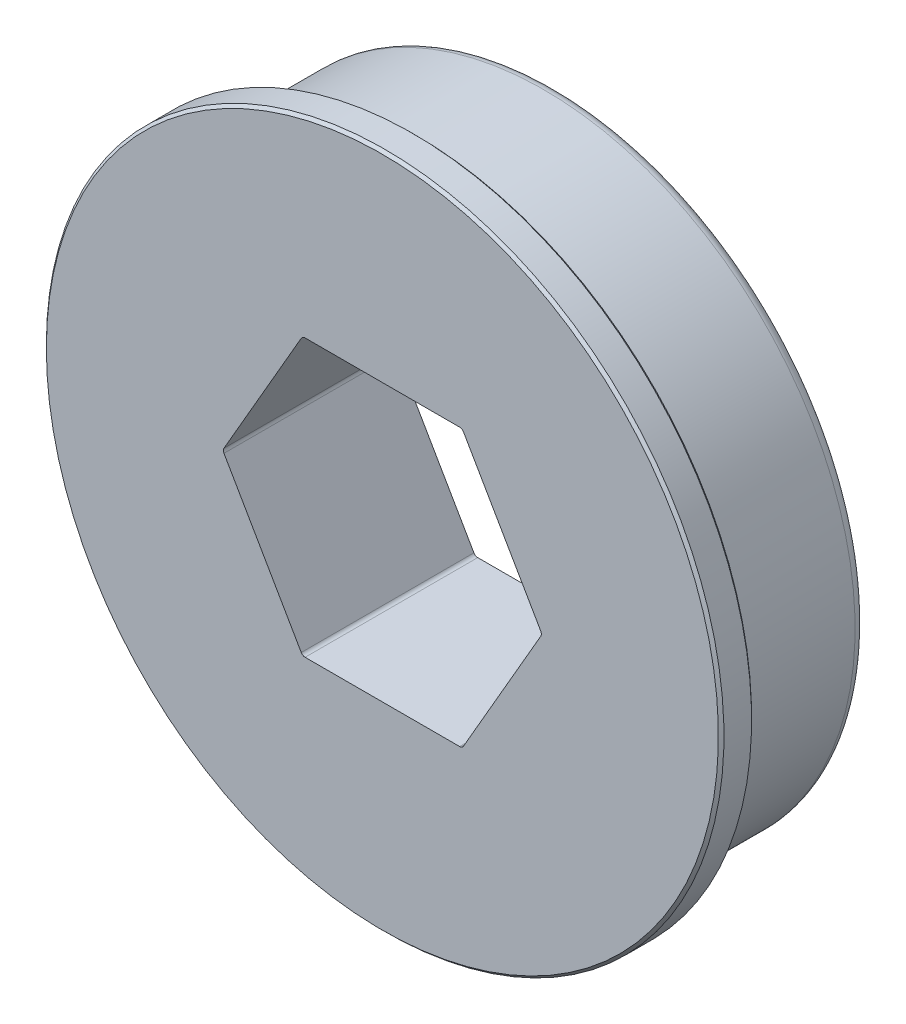
ISO-10303-21;
HEADER;
FILE_DESCRIPTION(('STEP AP214'),'2;1');
FILE_NAME('part.step','',(''),(''),'','','');
FILE_SCHEMA(('AUTOMOTIVE_DESIGN { 1 0 10303 214 1 1 1 1 }'));
ENDSEC;
DATA;
#1=APPLICATION_CONTEXT('core data for automotive mechanical design processes');
#2=APPLICATION_PROTOCOL_DEFINITION('international standard','automotive_design',2000,#1);
#3=PRODUCT_CONTEXT('',#1,'mechanical');
#4=PRODUCT('Part','Part','',(#3));
#5=PRODUCT_RELATED_PRODUCT_CATEGORY('part','',(#4));
#6=PRODUCT_DEFINITION_FORMATION('','',#4);
#7=PRODUCT_DEFINITION_CONTEXT('part definition',#1,'design');
#8=PRODUCT_DEFINITION('design','',#6,#7);
#9=PRODUCT_DEFINITION_SHAPE('','',#8);
#10=(LENGTH_UNIT() NAMED_UNIT(*) SI_UNIT(.MILLI.,.METRE.));
#11=(NAMED_UNIT(*) PLANE_ANGLE_UNIT() SI_UNIT($,.RADIAN.));
#12=(NAMED_UNIT(*) SI_UNIT($,.STERADIAN.) SOLID_ANGLE_UNIT());
#13=UNCERTAINTY_MEASURE_WITH_UNIT(LENGTH_MEASURE(1.E-05),#10,'distance_accuracy_value','');
#14=(GEOMETRIC_REPRESENTATION_CONTEXT(3) GLOBAL_UNCERTAINTY_ASSIGNED_CONTEXT((#13)) GLOBAL_UNIT_ASSIGNED_CONTEXT((#10,
#11,#12)) REPRESENTATION_CONTEXT('',''));
#15=CARTESIAN_POINT('',(0.,0.,0.));
#16=DIRECTION('',(0.,0.,1.));
#17=DIRECTION('',(1.,0.,0.));
#18=AXIS2_PLACEMENT_3D('',#15,#16,#17);
#19=CARTESIAN_POINT('',(0.,0.,7.80034));
#20=DIRECTION('',(0.,0.,-1.));
#21=DIRECTION('',(-1.,0.,0.));
#22=AXIS2_PLACEMENT_3D('',#19,#20,#21);
#23=CONICAL_SURFACE('',#22,15.5575,0.785398163397442);
#24=CARTESIAN_POINT('',(0.,0.,7.92734));
#25=DIRECTION('',(0.,0.,-1.));
#26=DIRECTION('',(-1.,0.,0.));
#27=AXIS2_PLACEMENT_3D('',#24,#25,#26);
#28=CIRCLE('',#27,15.4305);
#29=CARTESIAN_POINT('',(-15.4305,0.,7.92734));
#30=VERTEX_POINT('',#29);
#31=EDGE_CURVE('E180',#30,#30,#28,.T.);
#32=ORIENTED_EDGE('',*,*,#31,.T.);
#33=EDGE_LOOP('',(#32));
#34=FACE_BOUND('',#33,.T.);
#35=CARTESIAN_POINT('',(0.,0.,7.80034));
#36=DIRECTION('',(0.,0.,-1.));
#37=DIRECTION('',(-1.,0.,0.));
#38=AXIS2_PLACEMENT_3D('',#35,#36,#37);
#39=CIRCLE('',#38,15.5575);
#40=CARTESIAN_POINT('',(-15.5575,0.,7.80034));
#41=VERTEX_POINT('',#40);
#42=EDGE_CURVE('E167',#41,#41,#39,.T.);
#43=ORIENTED_EDGE('',*,*,#42,.F.);
#44=EDGE_LOOP('',(#43));
#45=FACE_BOUND('',#44,.T.);
#46=ADVANCED_FACE('F33',(#34,#45),#23,.T.);
#47=CARTESIAN_POINT('',(15.4305,0.,7.92734));
#48=DIRECTION('',(0.,0.,1.));
#49=DIRECTION('',(1.,0.,0.));
#50=AXIS2_PLACEMENT_3D('',#47,#48,#49);
#51=PLANE('',#50);
#52=DIRECTION('',(1.,0.,0.));
#53=VECTOR('',#52,1.);
#54=CARTESIAN_POINT('',(-3.66617420935412,-6.35,7.92734));
#55=LINE('',#54,#53);
#56=CARTESIAN_POINT('',(-3.54885663465478,-6.35,7.92734));
#57=VERTEX_POINT('',#56);
#58=CARTESIAN_POINT('',(3.5488566346548,-6.35000000000001,7.92734));
#59=VERTEX_POINT('',#58);
#60=EDGE_CURVE('E158',#57,#59,#55,.T.);
#61=ORIENTED_EDGE('',*,*,#60,.F.);
#62=CARTESIAN_POINT('',(-3.54885663465478,-6.1468,7.92734));
#63=DIRECTION('',(0.,0.,1.));
#64=DIRECTION('',(1.,0.,0.));
#65=AXIS2_PLACEMENT_3D('',#62,#63,#64);
#66=CIRCLE('',#65,0.2032);
#67=CARTESIAN_POINT('',(-3.72483299670378,-6.24840000000001,7.92734));
#68=VERTEX_POINT('',#67);
#69=EDGE_CURVE('E216',#57,#68,#66,.F.);
#70=ORIENTED_EDGE('',*,*,#69,.T.);
#71=DIRECTION('',(0.5,-0.866025403784439,0.));
#72=VECTOR('',#71,1.);
#73=CARTESIAN_POINT('',(-7.33234841870824,0.,7.92734));
#74=LINE('',#73,#72);
#75=CARTESIAN_POINT('',(-7.27368963135857,-0.101600000000002,7.92734));
#76=VERTEX_POINT('',#75);
#77=EDGE_CURVE('E163',#76,#68,#74,.T.);
#78=ORIENTED_EDGE('',*,*,#77,.F.);
#79=CARTESIAN_POINT('',(-7.09771326930958,0.,7.92734));
#80=DIRECTION('',(0.,0.,1.));
#81=DIRECTION('',(1.,0.,0.));
#82=AXIS2_PLACEMENT_3D('',#79,#80,#81);
#83=CIRCLE('',#82,0.2032);
#84=CARTESIAN_POINT('',(-7.27368963135857,0.101599999999999,7.92734));
#85=VERTEX_POINT('',#84);
#86=EDGE_CURVE('E224',#76,#85,#83,.F.);
#87=ORIENTED_EDGE('',*,*,#86,.T.);
#88=DIRECTION('',(-0.5,-0.866025403784439,0.));
#89=VECTOR('',#88,1.);
#90=CARTESIAN_POINT('',(-3.66617420935412,6.34999999999999,7.92734));
#91=LINE('',#90,#89);
#92=CARTESIAN_POINT('',(-3.72483299670379,6.24839999999999,7.92734));
#93=VERTEX_POINT('',#92);
#94=EDGE_CURVE('E156',#93,#85,#91,.T.);
#95=ORIENTED_EDGE('',*,*,#94,.F.);
#96=CARTESIAN_POINT('',(-3.54885663465479,6.14679999999999,7.92734));
#97=DIRECTION('',(0.,0.,1.));
#98=DIRECTION('',(1.,0.,0.));
#99=AXIS2_PLACEMENT_3D('',#96,#97,#98);
#100=CIRCLE('',#99,0.2032);
#101=CARTESIAN_POINT('',(-3.54885663465479,6.34999999999999,7.92734));
#102=VERTEX_POINT('',#101);
#103=EDGE_CURVE('E228',#93,#102,#100,.F.);
#104=ORIENTED_EDGE('',*,*,#103,.T.);
#105=DIRECTION('',(-1.,0.,0.));
#106=VECTOR('',#105,1.);
#107=CARTESIAN_POINT('',(3.66617420935413,6.35,7.92734));
#108=LINE('',#107,#106);
#109=CARTESIAN_POINT('',(3.5488566346548,6.35,7.92734));
#110=VERTEX_POINT('',#109);
#111=EDGE_CURVE('E152',#110,#102,#108,.T.);
#112=ORIENTED_EDGE('',*,*,#111,.F.);
#113=CARTESIAN_POINT('',(3.5488566346548,6.14679999999999,7.92734));
#114=DIRECTION('',(0.,0.,1.));
#115=DIRECTION('',(1.,0.,0.));
#116=AXIS2_PLACEMENT_3D('',#113,#114,#115);
#117=CIRCLE('',#116,0.2032);
#118=CARTESIAN_POINT('',(3.7248329967038,6.24839999999999,7.92734));
#119=VERTEX_POINT('',#118);
#120=EDGE_CURVE('E151',#110,#119,#117,.F.);
#121=ORIENTED_EDGE('',*,*,#120,.T.);
#122=DIRECTION('',(-0.5,0.866025403784438,0.));
#123=VECTOR('',#122,1.);
#124=CARTESIAN_POINT('',(7.33234841870826,0.,7.92734));
#125=LINE('',#124,#123);
#126=CARTESIAN_POINT('',(7.27368963135859,0.101599999999995,7.92734));
#127=VERTEX_POINT('',#126);
#128=EDGE_CURVE('E140',#127,#119,#125,.T.);
#129=ORIENTED_EDGE('',*,*,#128,.F.);
#130=CARTESIAN_POINT('',(7.09771326930959,0.,7.92734));
#131=DIRECTION('',(0.,0.,1.));
#132=DIRECTION('',(1.,0.,0.));
#133=AXIS2_PLACEMENT_3D('',#130,#131,#132);
#134=CIRCLE('',#133,0.2032);
#135=CARTESIAN_POINT('',(7.27368963135859,-0.101600000000005,7.92734));
#136=VERTEX_POINT('',#135);
#137=EDGE_CURVE('E124',#127,#136,#134,.F.);
#138=ORIENTED_EDGE('',*,*,#137,.T.);
#139=DIRECTION('',(0.5,0.866025403784439,0.));
#140=VECTOR('',#139,1.);
#141=CARTESIAN_POINT('',(3.66617420935413,-6.35000000000001,7.92734));
#142=LINE('',#141,#140);
#143=CARTESIAN_POINT('',(3.7248329967038,-6.24840000000001,7.92734));
#144=VERTEX_POINT('',#143);
#145=EDGE_CURVE('E153',#144,#136,#142,.T.);
#146=ORIENTED_EDGE('',*,*,#145,.F.);
#147=CARTESIAN_POINT('',(3.5488566346548,-6.14680000000001,7.92734));
#148=DIRECTION('',(0.,0.,1.));
#149=DIRECTION('',(1.,0.,0.));
#150=AXIS2_PLACEMENT_3D('',#147,#148,#149);
#151=CIRCLE('',#150,0.2032);
#152=EDGE_CURVE('E220',#144,#59,#151,.F.);
#153=ORIENTED_EDGE('',*,*,#152,.T.);
#154=EDGE_LOOP('',(#61,#70,#78,#87,#95,#104,#112,#121,#129,#138,#146,#153));
#155=FACE_BOUND('',#154,.T.);
#156=ORIENTED_EDGE('',*,*,#31,.F.);
#157=EDGE_LOOP('',(#156));
#158=FACE_BOUND('',#157,.T.);
#159=ADVANCED_FACE('F148',(#155,#158),#51,.T.);
#160=CARTESIAN_POINT('',(0.,0.,0.));
#161=DIRECTION('',(0.,0.,-1.));
#162=DIRECTION('',(-1.,0.,0.));
#163=AXIS2_PLACEMENT_3D('',#160,#161,#162);
#164=PLANE('',#163);
#165=CARTESIAN_POINT('',(0.,0.,0.));
#166=DIRECTION('',(0.,0.,-1.));
#167=DIRECTION('',(-1.,0.,0.));
#168=AXIS2_PLACEMENT_3D('',#165,#166,#167);
#169=CIRCLE('',#168,13.7795);
#170=CARTESIAN_POINT('',(-13.7795,0.,0.));
#171=VERTEX_POINT('',#170);
#172=EDGE_CURVE('E41',#171,#171,#169,.T.);
#173=ORIENTED_EDGE('',*,*,#172,.T.);
#174=EDGE_LOOP('',(#173));
#175=FACE_BOUND('',#174,.T.);
#176=DIRECTION('',(0.5,-0.866025403784439,0.));
#177=VECTOR('',#176,1.);
#178=CARTESIAN_POINT('',(-7.33234841870824,0.,0.));
#179=LINE('',#178,#177);
#180=CARTESIAN_POINT('',(-7.27368963135857,-0.101600000000002,0.));
#181=VERTEX_POINT('',#180);
#182=CARTESIAN_POINT('',(-3.72483299670378,-6.24840000000001,0.));
#183=VERTEX_POINT('',#182);
#184=EDGE_CURVE('E171',#181,#183,#179,.T.);
#185=ORIENTED_EDGE('',*,*,#184,.T.);
#186=CARTESIAN_POINT('',(-3.54885663465478,-6.1468,0.));
#187=DIRECTION('',(0.,0.,-1.));
#188=DIRECTION('',(-1.,0.,0.));
#189=AXIS2_PLACEMENT_3D('',#186,#187,#188);
#190=CIRCLE('',#189,0.2032);
#191=CARTESIAN_POINT('',(-3.54885663465478,-6.35,0.));
#192=VERTEX_POINT('',#191);
#193=EDGE_CURVE('E218',#183,#192,#190,.F.);
#194=ORIENTED_EDGE('',*,*,#193,.T.);
#195=DIRECTION('',(1.,0.,0.));
#196=VECTOR('',#195,1.);
#197=CARTESIAN_POINT('',(-3.66617420935412,-6.35,0.));
#198=LINE('',#197,#196);
#199=CARTESIAN_POINT('',(3.5488566346548,-6.35000000000001,0.));
#200=VERTEX_POINT('',#199);
#201=EDGE_CURVE('E166',#192,#200,#198,.T.);
#202=ORIENTED_EDGE('',*,*,#201,.T.);
#203=CARTESIAN_POINT('',(3.5488566346548,-6.14680000000001,0.));
#204=DIRECTION('',(0.,0.,-1.));
#205=DIRECTION('',(-1.,0.,0.));
#206=AXIS2_PLACEMENT_3D('',#203,#204,#205);
#207=CIRCLE('',#206,0.2032);
#208=CARTESIAN_POINT('',(3.7248329967038,-6.24840000000001,0.));
#209=VERTEX_POINT('',#208);
#210=EDGE_CURVE('E222',#200,#209,#207,.F.);
#211=ORIENTED_EDGE('',*,*,#210,.T.);
#212=DIRECTION('',(0.5,0.866025403784439,0.));
#213=VECTOR('',#212,1.);
#214=CARTESIAN_POINT('',(3.66617420935413,-6.35000000000001,0.));
#215=LINE('',#214,#213);
#216=CARTESIAN_POINT('',(7.27368963135859,-0.101600000000005,0.));
#217=VERTEX_POINT('',#216);
#218=EDGE_CURVE('E302',#209,#217,#215,.T.);
#219=ORIENTED_EDGE('',*,*,#218,.T.);
#220=CARTESIAN_POINT('',(7.09771326930959,0.,0.));
#221=DIRECTION('',(0.,0.,-1.));
#222=DIRECTION('',(-1.,0.,0.));
#223=AXIS2_PLACEMENT_3D('',#220,#221,#222);
#224=CIRCLE('',#223,0.2032);
#225=CARTESIAN_POINT('',(7.27368963135859,0.101599999999995,0.));
#226=VERTEX_POINT('',#225);
#227=EDGE_CURVE('E134',#217,#226,#224,.F.);
#228=ORIENTED_EDGE('',*,*,#227,.T.);
#229=DIRECTION('',(-0.5,0.866025403784438,0.));
#230=VECTOR('',#229,1.);
#231=CARTESIAN_POINT('',(7.33234841870826,0.,0.));
#232=LINE('',#231,#230);
#233=CARTESIAN_POINT('',(3.7248329967038,6.24839999999999,0.));
#234=VERTEX_POINT('',#233);
#235=EDGE_CURVE('E143',#226,#234,#232,.T.);
#236=ORIENTED_EDGE('',*,*,#235,.T.);
#237=CARTESIAN_POINT('',(3.5488566346548,6.14679999999999,0.));
#238=DIRECTION('',(0.,0.,-1.));
#239=DIRECTION('',(-1.,0.,0.));
#240=AXIS2_PLACEMENT_3D('',#237,#238,#239);
#241=CIRCLE('',#240,0.2032);
#242=CARTESIAN_POINT('',(3.5488566346548,6.35,0.));
#243=VERTEX_POINT('',#242);
#244=EDGE_CURVE('E214',#234,#243,#241,.F.);
#245=ORIENTED_EDGE('',*,*,#244,.T.);
#246=DIRECTION('',(-1.,0.,0.));
#247=VECTOR('',#246,1.);
#248=CARTESIAN_POINT('',(3.66617420935413,6.35,0.));
#249=LINE('',#248,#247);
#250=CARTESIAN_POINT('',(-3.54885663465479,6.34999999999999,0.));
#251=VERTEX_POINT('',#250);
#252=EDGE_CURVE('E288',#243,#251,#249,.T.);
#253=ORIENTED_EDGE('',*,*,#252,.T.);
#254=CARTESIAN_POINT('',(-3.54885663465479,6.14679999999999,0.));
#255=DIRECTION('',(0.,0.,-1.));
#256=DIRECTION('',(-1.,0.,0.));
#257=AXIS2_PLACEMENT_3D('',#254,#255,#256);
#258=CIRCLE('',#257,0.2032);
#259=CARTESIAN_POINT('',(-3.72483299670379,6.24839999999999,0.));
#260=VERTEX_POINT('',#259);
#261=EDGE_CURVE('E55',#251,#260,#258,.F.);
#262=ORIENTED_EDGE('',*,*,#261,.T.);
#263=DIRECTION('',(-0.5,-0.866025403784439,0.));
#264=VECTOR('',#263,1.);
#265=CARTESIAN_POINT('',(-3.66617420935412,6.34999999999999,0.));
#266=LINE('',#265,#264);
#267=CARTESIAN_POINT('',(-7.27368963135857,0.101599999999999,0.));
#268=VERTEX_POINT('',#267);
#269=EDGE_CURVE('E282',#260,#268,#266,.T.);
#270=ORIENTED_EDGE('',*,*,#269,.T.);
#271=CARTESIAN_POINT('',(-7.09771326930958,0.,0.));
#272=DIRECTION('',(0.,0.,-1.));
#273=DIRECTION('',(-1.,0.,0.));
#274=AXIS2_PLACEMENT_3D('',#271,#272,#273);
#275=CIRCLE('',#274,0.2032);
#276=EDGE_CURVE('E226',#268,#181,#275,.F.);
#277=ORIENTED_EDGE('',*,*,#276,.T.);
#278=EDGE_LOOP('',(#185,#194,#202,#211,#219,#228,#236,#245,#253,#262,#270,#277));
#279=FACE_BOUND('',#278,.T.);
#280=ADVANCED_FACE('F233',(#175,#279),#164,.T.);
#281=CARTESIAN_POINT('',(0.,0.,7.92734));
#282=DIRECTION('',(0.,0.,-1.));
#283=DIRECTION('',(-1.,0.,0.));
#284=AXIS2_PLACEMENT_3D('',#281,#282,#283);
#285=CYLINDRICAL_SURFACE('',#284,14.2875);
#286=CARTESIAN_POINT('',(0.,0.,0.508));
#287=DIRECTION('',(0.,0.,-1.));
#288=DIRECTION('',(-1.,0.,0.));
#289=AXIS2_PLACEMENT_3D('',#286,#287,#288);
#290=CIRCLE('',#289,14.2875);
#291=CARTESIAN_POINT('',(-14.2875,0.,0.508));
#292=VERTEX_POINT('',#291);
#293=EDGE_CURVE('E11',#292,#292,#290,.F.);
#294=ORIENTED_EDGE('',*,*,#293,.T.);
#295=EDGE_LOOP('',(#294));
#296=FACE_BOUND('',#295,.T.);
#297=CARTESIAN_POINT('',(0.,0.,5.89534));
#298=DIRECTION('',(0.,0.,-1.));
#299=DIRECTION('',(-1.,0.,0.));
#300=AXIS2_PLACEMENT_3D('',#297,#298,#299);
#301=CIRCLE('',#300,14.2875);
#302=CARTESIAN_POINT('',(-14.2875,0.,5.89534));
#303=VERTEX_POINT('',#302);
#304=EDGE_CURVE('E177',#303,#303,#301,.T.);
#305=ORIENTED_EDGE('',*,*,#304,.T.);
#306=EDGE_LOOP('',(#305));
#307=FACE_BOUND('',#306,.T.);
#308=ADVANCED_FACE('F345',(#296,#307),#285,.T.);
#309=CARTESIAN_POINT('',(14.2875,0.,5.89534));
#310=DIRECTION('',(0.,0.,1.));
#311=DIRECTION('',(1.,0.,0.));
#312=AXIS2_PLACEMENT_3D('',#309,#310,#311);
#313=PLANE('',#312);
#314=CARTESIAN_POINT('',(0.,0.,5.89534));
#315=DIRECTION('',(0.,0.,-1.));
#316=DIRECTION('',(-1.,0.,0.));
#317=AXIS2_PLACEMENT_3D('',#314,#315,#316);
#318=CIRCLE('',#317,13.97);
#319=CARTESIAN_POINT('',(-13.97,0.,5.89534));
#320=VERTEX_POINT('',#319);
#321=EDGE_CURVE('E174',#320,#320,#318,.T.);
#322=ORIENTED_EDGE('',*,*,#321,.T.);
#323=EDGE_LOOP('',(#322));
#324=FACE_BOUND('',#323,.T.);
#325=ORIENTED_EDGE('',*,*,#304,.F.);
#326=EDGE_LOOP('',(#325));
#327=FACE_BOUND('',#326,.T.);
#328=ADVANCED_FACE('F341',(#324,#327),#313,.T.);
#329=CARTESIAN_POINT('',(0.,0.,7.92734));
#330=DIRECTION('',(0.,0.,-1.));
#331=DIRECTION('',(-1.,0.,0.));
#332=AXIS2_PLACEMENT_3D('',#329,#330,#331);
#333=CYLINDRICAL_SURFACE('',#332,13.97);
#334=CARTESIAN_POINT('',(0.,0.,6.40333999999999));
#335=DIRECTION('',(0.,0.,-1.));
#336=DIRECTION('',(-1.,0.,0.));
#337=AXIS2_PLACEMENT_3D('',#334,#335,#336);
#338=CIRCLE('',#337,13.97);
#339=CARTESIAN_POINT('',(-13.97,0.,6.40333999999999));
#340=VERTEX_POINT('',#339);
#341=EDGE_CURVE('E170',#340,#340,#338,.T.);
#342=ORIENTED_EDGE('',*,*,#341,.T.);
#343=EDGE_LOOP('',(#342));
#344=FACE_BOUND('',#343,.T.);
#345=ORIENTED_EDGE('',*,*,#321,.F.);
#346=EDGE_LOOP('',(#345));
#347=FACE_BOUND('',#346,.T.);
#348=ADVANCED_FACE('F337',(#344,#347),#333,.T.);
#349=CARTESIAN_POINT('',(13.97,0.,6.40334));
#350=DIRECTION('',(0.,0.,-1.));
#351=DIRECTION('',(-1.,0.,0.));
#352=AXIS2_PLACEMENT_3D('',#349,#350,#351);
#353=PLANE('',#352);
#354=CARTESIAN_POINT('',(0.,0.,6.40334));
#355=DIRECTION('',(0.,0.,-1.));
#356=DIRECTION('',(-1.,0.,0.));
#357=AXIS2_PLACEMENT_3D('',#354,#355,#356);
#358=CIRCLE('',#357,15.4304999999999);
#359=CARTESIAN_POINT('',(-15.4304999999999,0.,6.40334));
#360=VERTEX_POINT('',#359);
#361=EDGE_CURVE('E183',#360,#360,#358,.T.);
#362=ORIENTED_EDGE('',*,*,#361,.T.);
#363=EDGE_LOOP('',(#362));
#364=FACE_BOUND('',#363,.T.);
#365=ORIENTED_EDGE('',*,*,#341,.F.);
#366=EDGE_LOOP('',(#365));
#367=FACE_BOUND('',#366,.T.);
#368=ADVANCED_FACE('F333',(#364,#367),#353,.T.);
#369=CARTESIAN_POINT('',(0.,0.,7.92734));
#370=DIRECTION('',(0.,0.,-1.));
#371=DIRECTION('',(-1.,0.,0.));
#372=AXIS2_PLACEMENT_3D('',#369,#370,#371);
#373=CYLINDRICAL_SURFACE('',#372,15.5575);
#374=CARTESIAN_POINT('',(0.,0.,6.53034000000008));
#375=DIRECTION('',(0.,0.,-1.));
#376=DIRECTION('',(-1.,0.,0.));
#377=AXIS2_PLACEMENT_3D('',#374,#375,#376);
#378=CIRCLE('',#377,15.5575);
#379=CARTESIAN_POINT('',(-15.5575,0.,6.53034000000008));
#380=VERTEX_POINT('',#379);
#381=EDGE_CURVE('E186',#380,#380,#378,.F.);
#382=ORIENTED_EDGE('',*,*,#381,.T.);
#383=EDGE_LOOP('',(#382));
#384=FACE_BOUND('',#383,.T.);
#385=ORIENTED_EDGE('',*,*,#42,.T.);
#386=EDGE_LOOP('',(#385));
#387=FACE_BOUND('',#386,.T.);
#388=ADVANCED_FACE('F330',(#384,#387),#373,.T.);
#389=CARTESIAN_POINT('',(-3.66617420935412,-6.35,0.));
#390=DIRECTION('',(0.,-1.,0.));
#391=DIRECTION('',(1.,0.,0.));
#392=AXIS2_PLACEMENT_3D('',#389,#390,#391);
#393=PLANE('',#392);
#394=ORIENTED_EDGE('',*,*,#201,.F.);
#395=DIRECTION('',(0.,0.,1.));
#396=VECTOR('',#395,1.);
#397=CARTESIAN_POINT('',(-3.54885663465478,-6.35,7.92734));
#398=LINE('',#397,#396);
#399=EDGE_CURVE('E200',#192,#57,#398,.T.);
#400=ORIENTED_EDGE('',*,*,#399,.T.);
#401=ORIENTED_EDGE('',*,*,#60,.T.);
#402=DIRECTION('',(0.,0.,1.));
#403=VECTOR('',#402,1.);
#404=CARTESIAN_POINT('',(3.5488566346548,-6.35000000000001,0.));
#405=LINE('',#404,#403);
#406=EDGE_CURVE('E198',#59,#200,#405,.F.);
#407=ORIENTED_EDGE('',*,*,#406,.T.);
#408=EDGE_LOOP('',(#394,#400,#401,#407));
#409=FACE_BOUND('',#408,.T.);
#410=ADVANCED_FACE('F295',(#409),#393,.F.);
#411=CARTESIAN_POINT('',(-7.33234841870824,0.,0.));
#412=DIRECTION('',(-0.866025403784439,-0.5,0.));
#413=DIRECTION('',(0.5,-0.866025403784439,0.));
#414=AXIS2_PLACEMENT_3D('',#411,#412,#413);
#415=PLANE('',#414);
#416=ORIENTED_EDGE('',*,*,#77,.T.);
#417=DIRECTION('',(0.,0.,1.));
#418=VECTOR('',#417,1.);
#419=CARTESIAN_POINT('',(-3.72483299670378,-6.2484,0.));
#420=LINE('',#419,#418);
#421=EDGE_CURVE('E206',#68,#183,#420,.F.);
#422=ORIENTED_EDGE('',*,*,#421,.T.);
#423=ORIENTED_EDGE('',*,*,#184,.F.);
#424=DIRECTION('',(0.,0.,1.));
#425=VECTOR('',#424,1.);
#426=CARTESIAN_POINT('',(-7.27368963135857,-0.101600000000002,7.92734));
#427=LINE('',#426,#425);
#428=EDGE_CURVE('E203',#181,#76,#427,.T.);
#429=ORIENTED_EDGE('',*,*,#428,.T.);
#430=EDGE_LOOP('',(#416,#422,#423,#429));
#431=FACE_BOUND('',#430,.T.);
#432=ADVANCED_FACE('F284',(#431),#415,.F.);
#433=CARTESIAN_POINT('',(-3.66617420935412,6.34999999999999,0.));
#434=DIRECTION('',(-0.866025403784439,0.5,0.));
#435=DIRECTION('',(-0.5,-0.866025403784439,0.));
#436=AXIS2_PLACEMENT_3D('',#433,#434,#435);
#437=PLANE('',#436);
#438=ORIENTED_EDGE('',*,*,#94,.T.);
#439=DIRECTION('',(0.,0.,1.));
#440=VECTOR('',#439,1.);
#441=CARTESIAN_POINT('',(-7.27368963135857,0.101599999999998,0.));
#442=LINE('',#441,#440);
#443=EDGE_CURVE('E48',#85,#268,#442,.F.);
#444=ORIENTED_EDGE('',*,*,#443,.T.);
#445=ORIENTED_EDGE('',*,*,#269,.F.);
#446=DIRECTION('',(0.,0.,1.));
#447=VECTOR('',#446,1.);
#448=CARTESIAN_POINT('',(-3.72483299670379,6.24839999999999,7.92734));
#449=LINE('',#448,#447);
#450=EDGE_CURVE('E208',#260,#93,#449,.T.);
#451=ORIENTED_EDGE('',*,*,#450,.T.);
#452=EDGE_LOOP('',(#438,#444,#445,#451));
#453=FACE_BOUND('',#452,.T.);
#454=ADVANCED_FACE('F314',(#453),#437,.F.);
#455=CARTESIAN_POINT('',(3.66617420935413,6.35,0.));
#456=DIRECTION('',(0.,1.,0.));
#457=DIRECTION('',(-1.,0.,0.));
#458=AXIS2_PLACEMENT_3D('',#455,#456,#457);
#459=PLANE('',#458);
#460=ORIENTED_EDGE('',*,*,#252,.F.);
#461=DIRECTION('',(0.,0.,1.));
#462=VECTOR('',#461,1.);
#463=CARTESIAN_POINT('',(3.5488566346548,6.35,7.92734));
#464=LINE('',#463,#462);
#465=EDGE_CURVE('E195',#243,#110,#464,.T.);
#466=ORIENTED_EDGE('',*,*,#465,.T.);
#467=ORIENTED_EDGE('',*,*,#111,.T.);
#468=DIRECTION('',(0.,0.,1.));
#469=VECTOR('',#468,1.);
#470=CARTESIAN_POINT('',(-3.54885663465479,6.34999999999999,0.));
#471=LINE('',#470,#469);
#472=EDGE_CURVE('E193',#102,#251,#471,.F.);
#473=ORIENTED_EDGE('',*,*,#472,.T.);
#474=EDGE_LOOP('',(#460,#466,#467,#473));
#475=FACE_BOUND('',#474,.T.);
#476=ADVANCED_FACE('F315',(#475),#459,.F.);
#477=CARTESIAN_POINT('',(7.33234841870826,0.,0.));
#478=DIRECTION('',(0.866025403784438,0.5,0.));
#479=DIRECTION('',(-0.5,0.866025403784439,0.));
#480=AXIS2_PLACEMENT_3D('',#477,#478,#479);
#481=PLANE('',#480);
#482=ORIENTED_EDGE('',*,*,#235,.F.);
#483=DIRECTION('',(0.,0.,1.));
#484=VECTOR('',#483,1.);
#485=CARTESIAN_POINT('',(7.27368963135859,0.101599999999995,7.92734));
#486=LINE('',#485,#484);
#487=EDGE_CURVE('E128',#226,#127,#486,.T.);
#488=ORIENTED_EDGE('',*,*,#487,.T.);
#489=ORIENTED_EDGE('',*,*,#128,.T.);
#490=DIRECTION('',(0.,0.,1.));
#491=VECTOR('',#490,1.);
#492=CARTESIAN_POINT('',(3.7248329967038,6.24839999999999,0.));
#493=LINE('',#492,#491);
#494=EDGE_CURVE('E145',#119,#234,#493,.F.);
#495=ORIENTED_EDGE('',*,*,#494,.T.);
#496=EDGE_LOOP('',(#482,#488,#489,#495));
#497=FACE_BOUND('',#496,.T.);
#498=ADVANCED_FACE('F139',(#497),#481,.F.);
#499=CARTESIAN_POINT('',(3.66617420935413,-6.35000000000001,0.));
#500=DIRECTION('',(0.866025403784439,-0.5,0.));
#501=DIRECTION('',(0.5,0.866025403784439,0.));
#502=AXIS2_PLACEMENT_3D('',#499,#500,#501);
#503=PLANE('',#502);
#504=ORIENTED_EDGE('',*,*,#145,.T.);
#505=DIRECTION('',(0.,0.,1.));
#506=VECTOR('',#505,1.);
#507=CARTESIAN_POINT('',(7.27368963135859,-0.101600000000005,0.));
#508=LINE('',#507,#506);
#509=EDGE_CURVE('E129',#136,#217,#508,.F.);
#510=ORIENTED_EDGE('',*,*,#509,.T.);
#511=ORIENTED_EDGE('',*,*,#218,.F.);
#512=DIRECTION('',(0.,0.,1.));
#513=VECTOR('',#512,1.);
#514=CARTESIAN_POINT('',(3.7248329967038,-6.24840000000001,7.92734));
#515=LINE('',#514,#513);
#516=EDGE_CURVE('E144',#209,#144,#515,.T.);
#517=ORIENTED_EDGE('',*,*,#516,.T.);
#518=EDGE_LOOP('',(#504,#510,#511,#517));
#519=FACE_BOUND('',#518,.T.);
#520=ADVANCED_FACE('F257',(#519),#503,.F.);
#521=CARTESIAN_POINT('',(0.,0.,6.40334));
#522=DIRECTION('',(0.,0.,1.));
#523=DIRECTION('',(1.,0.,0.));
#524=AXIS2_PLACEMENT_3D('',#521,#522,#523);
#525=CONICAL_SURFACE('',#524,15.4304999999999,0.785398163397421);
#526=ORIENTED_EDGE('',*,*,#381,.F.);
#527=EDGE_LOOP('',(#526));
#528=FACE_BOUND('',#527,.T.);
#529=ORIENTED_EDGE('',*,*,#361,.F.);
#530=EDGE_LOOP('',(#529));
#531=FACE_BOUND('',#530,.T.);
#532=ADVANCED_FACE('F254',(#528,#531),#525,.T.);
#533=CARTESIAN_POINT('',(7.09771326930959,0.,0.));
#534=DIRECTION('',(0.,0.,-1.));
#535=DIRECTION('',(-1.,0.,0.));
#536=AXIS2_PLACEMENT_3D('',#533,#534,#535);
#537=CYLINDRICAL_SURFACE('',#536,0.2032);
#538=ORIENTED_EDGE('',*,*,#227,.F.);
#539=ORIENTED_EDGE('',*,*,#509,.F.);
#540=ORIENTED_EDGE('',*,*,#137,.F.);
#541=ORIENTED_EDGE('',*,*,#487,.F.);
#542=EDGE_LOOP('',(#538,#539,#540,#541));
#543=FACE_BOUND('',#542,.T.);
#544=ADVANCED_FACE('F127',(#543),#537,.F.);
#545=CARTESIAN_POINT('',(3.5488566346548,6.14679999999999,0.));
#546=DIRECTION('',(0.,0.,-1.));
#547=DIRECTION('',(-1.,0.,0.));
#548=AXIS2_PLACEMENT_3D('',#545,#546,#547);
#549=CYLINDRICAL_SURFACE('',#548,0.2032);
#550=ORIENTED_EDGE('',*,*,#244,.F.);
#551=ORIENTED_EDGE('',*,*,#494,.F.);
#552=ORIENTED_EDGE('',*,*,#120,.F.);
#553=ORIENTED_EDGE('',*,*,#465,.F.);
#554=EDGE_LOOP('',(#550,#551,#552,#553));
#555=FACE_BOUND('',#554,.T.);
#556=ADVANCED_FACE('F261',(#555),#549,.F.);
#557=CARTESIAN_POINT('',(-3.54885663465478,-6.1468,0.));
#558=DIRECTION('',(0.,0.,-1.));
#559=DIRECTION('',(-1.,0.,0.));
#560=AXIS2_PLACEMENT_3D('',#557,#558,#559);
#561=CYLINDRICAL_SURFACE('',#560,0.2032);
#562=ORIENTED_EDGE('',*,*,#193,.F.);
#563=ORIENTED_EDGE('',*,*,#421,.F.);
#564=ORIENTED_EDGE('',*,*,#69,.F.);
#565=ORIENTED_EDGE('',*,*,#399,.F.);
#566=EDGE_LOOP('',(#562,#563,#564,#565));
#567=FACE_BOUND('',#566,.T.);
#568=ADVANCED_FACE('F264',(#567),#561,.F.);
#569=CARTESIAN_POINT('',(3.5488566346548,-6.14680000000001,0.));
#570=DIRECTION('',(0.,0.,-1.));
#571=DIRECTION('',(-1.,0.,0.));
#572=AXIS2_PLACEMENT_3D('',#569,#570,#571);
#573=CYLINDRICAL_SURFACE('',#572,0.2032);
#574=ORIENTED_EDGE('',*,*,#210,.F.);
#575=ORIENTED_EDGE('',*,*,#406,.F.);
#576=ORIENTED_EDGE('',*,*,#152,.F.);
#577=ORIENTED_EDGE('',*,*,#516,.F.);
#578=EDGE_LOOP('',(#574,#575,#576,#577));
#579=FACE_BOUND('',#578,.T.);
#580=ADVANCED_FACE('F268',(#579),#573,.F.);
#581=CARTESIAN_POINT('',(-7.09771326930958,0.,0.));
#582=DIRECTION('',(0.,0.,-1.));
#583=DIRECTION('',(-1.,0.,0.));
#584=AXIS2_PLACEMENT_3D('',#581,#582,#583);
#585=CYLINDRICAL_SURFACE('',#584,0.2032);
#586=ORIENTED_EDGE('',*,*,#276,.F.);
#587=ORIENTED_EDGE('',*,*,#443,.F.);
#588=ORIENTED_EDGE('',*,*,#86,.F.);
#589=ORIENTED_EDGE('',*,*,#428,.F.);
#590=EDGE_LOOP('',(#586,#587,#588,#589));
#591=FACE_BOUND('',#590,.T.);
#592=ADVANCED_FACE('F241',(#591),#585,.F.);
#593=CARTESIAN_POINT('',(-3.54885663465479,6.14679999999999,0.));
#594=DIRECTION('',(0.,0.,-1.));
#595=DIRECTION('',(-1.,0.,0.));
#596=AXIS2_PLACEMENT_3D('',#593,#594,#595);
#597=CYLINDRICAL_SURFACE('',#596,0.2032);
#598=ORIENTED_EDGE('',*,*,#261,.F.);
#599=ORIENTED_EDGE('',*,*,#472,.F.);
#600=ORIENTED_EDGE('',*,*,#103,.F.);
#601=ORIENTED_EDGE('',*,*,#450,.F.);
#602=EDGE_LOOP('',(#598,#599,#600,#601));
#603=FACE_BOUND('',#602,.T.);
#604=ADVANCED_FACE('F236',(#603),#597,.F.);
#605=CARTESIAN_POINT('',(0.,0.,0.508));
#606=DIRECTION('',(0.,0.,-1.));
#607=DIRECTION('',(-1.,0.,0.));
#608=AXIS2_PLACEMENT_3D('',#605,#606,#607);
#609=TOROIDAL_SURFACE('',#608,13.7795,0.508);
#610=ORIENTED_EDGE('',*,*,#293,.F.);
#611=EDGE_LOOP('',(#610));
#612=FACE_BOUND('',#611,.T.);
#613=ORIENTED_EDGE('',*,*,#172,.F.);
#614=EDGE_LOOP('',(#613));
#615=FACE_BOUND('',#614,.T.);
#616=ADVANCED_FACE('F35',(#612,#615),#609,.T.);
#617=CLOSED_SHELL('',(#46,#159,#280,#308,#328,#348,#368,#388,#410,#432,#454,#476,#498,#520,#532,
#544,#556,#568,#580,#592,#604,#616));
#618=MANIFOLD_SOLID_BREP('B2',#617);
#619=ADVANCED_BREP_SHAPE_REPRESENTATION('',(#18,#618),#14);
#620=SHAPE_DEFINITION_REPRESENTATION(#9,#619);
ENDSEC;
END-ISO-10303-21;
